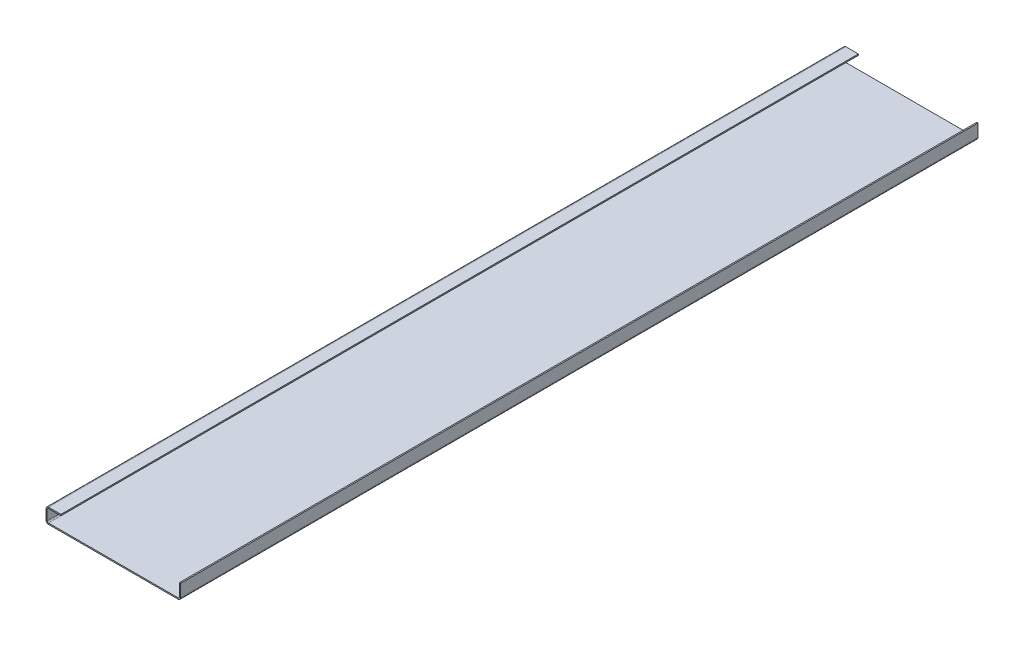
ISO-10303-21;
HEADER;
FILE_DESCRIPTION(('STEP AP214'),'2;1');
FILE_NAME('part.step','',(''),(''),'','','');
FILE_SCHEMA(('AUTOMOTIVE_DESIGN { 1 0 10303 214 1 1 1 1 }'));
ENDSEC;
DATA;
#1=APPLICATION_CONTEXT('core data for automotive mechanical design processes');
#2=APPLICATION_PROTOCOL_DEFINITION('international standard','automotive_design',2000,#1);
#3=PRODUCT_CONTEXT('',#1,'mechanical');
#4=PRODUCT('Part','Part','',(#3));
#5=PRODUCT_RELATED_PRODUCT_CATEGORY('part','',(#4));
#6=PRODUCT_DEFINITION_FORMATION('','',#4);
#7=PRODUCT_DEFINITION_CONTEXT('part definition',#1,'design');
#8=PRODUCT_DEFINITION('design','',#6,#7);
#9=PRODUCT_DEFINITION_SHAPE('','',#8);
#10=(LENGTH_UNIT() NAMED_UNIT(*) SI_UNIT(.MILLI.,.METRE.));
#11=(NAMED_UNIT(*) PLANE_ANGLE_UNIT() SI_UNIT($,.RADIAN.));
#12=(NAMED_UNIT(*) SI_UNIT($,.STERADIAN.) SOLID_ANGLE_UNIT());
#13=UNCERTAINTY_MEASURE_WITH_UNIT(LENGTH_MEASURE(1.E-05),#10,'distance_accuracy_value','');
#14=(GEOMETRIC_REPRESENTATION_CONTEXT(3) GLOBAL_UNCERTAINTY_ASSIGNED_CONTEXT((#13)) GLOBAL_UNIT_ASSIGNED_CONTEXT((#10,
#11,#12)) REPRESENTATION_CONTEXT('',''));
#15=CARTESIAN_POINT('',(0.,0.,0.));
#16=DIRECTION('',(0.,0.,1.));
#17=DIRECTION('',(1.,0.,0.));
#18=AXIS2_PLACEMENT_3D('',#15,#16,#17);
#19=CARTESIAN_POINT('',(-25.,0.,1600.));
#20=DIRECTION('',(0.,0.,1.));
#21=DIRECTION('',(1.,0.,0.));
#22=AXIS2_PLACEMENT_3D('',#19,#20,#21);
#23=PLANE('',#22);
#24=DIRECTION('',(0.,-1.,0.));
#25=VECTOR('',#24,1.);
#26=CARTESIAN_POINT('',(-25.,0.,1600.));
#27=LINE('',#26,#25);
#28=CARTESIAN_POINT('',(-25.,0.,1600.));
#29=VERTEX_POINT('',#28);
#30=CARTESIAN_POINT('',(-25.,-2.5,1600.));
#31=VERTEX_POINT('',#30);
#32=EDGE_CURVE('E11',#29,#31,#27,.T.);
#33=ORIENTED_EDGE('',*,*,#32,.F.);
#34=CARTESIAN_POINT('',(-25.,-5.,1600.));
#35=DIRECTION('',(0.,0.,-1.));
#36=DIRECTION('',(-1.,0.,0.));
#37=AXIS2_PLACEMENT_3D('',#34,#35,#36);
#38=CIRCLE('',#37,5.);
#39=CARTESIAN_POINT('',(-30.,-5.,1600.));
#40=VERTEX_POINT('',#39);
#41=EDGE_CURVE('E308',#29,#40,#38,.F.);
#42=ORIENTED_EDGE('',*,*,#41,.T.);
#43=DIRECTION('',(-1.,0.,0.));
#44=VECTOR('',#43,1.);
#45=CARTESIAN_POINT('',(-27.5,-5.,1600.));
#46=LINE('',#45,#44);
#47=CARTESIAN_POINT('',(-27.5,-5.,1600.));
#48=VERTEX_POINT('',#47);
#49=EDGE_CURVE('E49',#48,#40,#46,.T.);
#50=ORIENTED_EDGE('',*,*,#49,.F.);
#51=CARTESIAN_POINT('',(-25.,-5.,1600.));
#52=DIRECTION('',(0.,0.,1.));
#53=DIRECTION('',(1.,0.,0.));
#54=AXIS2_PLACEMENT_3D('',#51,#52,#53);
#55=CIRCLE('',#54,2.5);
#56=EDGE_CURVE('E327',#31,#48,#55,.T.);
#57=ORIENTED_EDGE('',*,*,#56,.F.);
#58=EDGE_LOOP('',(#33,#42,#50,#57));
#59=FACE_BOUND('',#58,.T.);
#60=ADVANCED_FACE('F41',(#59),#23,.T.);
#61=CARTESIAN_POINT('',(-27.5,-5.,1600.));
#62=DIRECTION('',(0.,0.,1.));
#63=DIRECTION('',(1.,0.,0.));
#64=AXIS2_PLACEMENT_3D('',#61,#62,#63);
#65=PLANE('',#64);
#66=DIRECTION('',(-1.,0.,0.));
#67=VECTOR('',#66,1.);
#68=CARTESIAN_POINT('',(0.,0.,1600.));
#69=LINE('',#68,#67);
#70=CARTESIAN_POINT('',(0.,0.,1600.));
#71=VERTEX_POINT('',#70);
#72=EDGE_CURVE('E312',#71,#29,#69,.T.);
#73=ORIENTED_EDGE('',*,*,#72,.T.);
#74=ORIENTED_EDGE('',*,*,#32,.T.);
#75=DIRECTION('',(-1.,0.,0.));
#76=VECTOR('',#75,1.);
#77=CARTESIAN_POINT('',(0.,-2.5,1600.));
#78=LINE('',#77,#76);
#79=CARTESIAN_POINT('',(0.,-2.5,1600.));
#80=VERTEX_POINT('',#79);
#81=EDGE_CURVE('E324',#80,#31,#78,.T.);
#82=ORIENTED_EDGE('',*,*,#81,.F.);
#83=DIRECTION('',(0.,-1.,0.));
#84=VECTOR('',#83,1.);
#85=CARTESIAN_POINT('',(0.,0.,1600.));
#86=LINE('',#85,#84);
#87=EDGE_CURVE('E321',#71,#80,#86,.T.);
#88=ORIENTED_EDGE('',*,*,#87,.F.);
#89=EDGE_LOOP('',(#73,#74,#82,#88));
#90=FACE_BOUND('',#89,.T.);
#91=ADVANCED_FACE('F377',(#90),#65,.T.);
#92=CARTESIAN_POINT('',(-30.,-5.,0.));
#93=DIRECTION('',(0.,0.,-1.));
#94=DIRECTION('',(-1.,0.,0.));
#95=AXIS2_PLACEMENT_3D('',#92,#93,#94);
#96=PLANE('',#95);
#97=DIRECTION('',(1.,0.,0.));
#98=VECTOR('',#97,1.);
#99=CARTESIAN_POINT('',(-30.,-5.,0.));
#100=LINE('',#99,#98);
#101=CARTESIAN_POINT('',(-30.,-5.,0.));
#102=VERTEX_POINT('',#101);
#103=CARTESIAN_POINT('',(-27.5,-5.,0.));
#104=VERTEX_POINT('',#103);
#105=EDGE_CURVE('E294',#102,#104,#100,.T.);
#106=ORIENTED_EDGE('',*,*,#105,.F.);
#107=CARTESIAN_POINT('',(-25.,-5.,0.));
#108=DIRECTION('',(0.,0.,-1.));
#109=DIRECTION('',(-1.,0.,0.));
#110=AXIS2_PLACEMENT_3D('',#107,#108,#109);
#111=CIRCLE('',#110,5.);
#112=CARTESIAN_POINT('',(-25.,0.,0.));
#113=VERTEX_POINT('',#112);
#114=EDGE_CURVE('E236',#113,#102,#111,.F.);
#115=ORIENTED_EDGE('',*,*,#114,.F.);
#116=DIRECTION('',(0.,1.,0.));
#117=VECTOR('',#116,1.);
#118=CARTESIAN_POINT('',(-25.,-2.5,0.));
#119=LINE('',#118,#117);
#120=CARTESIAN_POINT('',(-25.,-2.5,0.));
#121=VERTEX_POINT('',#120);
#122=EDGE_CURVE('E292',#121,#113,#119,.T.);
#123=ORIENTED_EDGE('',*,*,#122,.F.);
#124=CARTESIAN_POINT('',(-25.,-5.,0.));
#125=DIRECTION('',(0.,0.,1.));
#126=DIRECTION('',(1.,0.,0.));
#127=AXIS2_PLACEMENT_3D('',#124,#125,#126);
#128=CIRCLE('',#127,2.5);
#129=EDGE_CURVE('E224',#121,#104,#128,.T.);
#130=ORIENTED_EDGE('',*,*,#129,.T.);
#131=EDGE_LOOP('',(#106,#115,#123,#130));
#132=FACE_BOUND('',#131,.T.);
#133=ADVANCED_FACE('F387',(#132),#96,.T.);
#134=CARTESIAN_POINT('',(-25.,-2.5,0.));
#135=DIRECTION('',(0.,0.,-1.));
#136=DIRECTION('',(-1.,0.,0.));
#137=AXIS2_PLACEMENT_3D('',#134,#135,#136);
#138=PLANE('',#137);
#139=DIRECTION('',(0.,-1.,0.));
#140=VECTOR('',#139,1.);
#141=CARTESIAN_POINT('',(-30.,0.,0.));
#142=LINE('',#141,#140);
#143=CARTESIAN_POINT('',(-30.,-25.,0.));
#144=VERTEX_POINT('',#143);
#145=EDGE_CURVE('E239',#102,#144,#142,.T.);
#146=ORIENTED_EDGE('',*,*,#145,.F.);
#147=ORIENTED_EDGE('',*,*,#105,.T.);
#148=DIRECTION('',(0.,1.,0.));
#149=VECTOR('',#148,1.);
#150=CARTESIAN_POINT('',(-27.5,0.,0.));
#151=LINE('',#150,#149);
#152=CARTESIAN_POINT('',(-27.5,-25.,0.));
#153=VERTEX_POINT('',#152);
#154=EDGE_CURVE('E221',#104,#153,#151,.F.);
#155=ORIENTED_EDGE('',*,*,#154,.T.);
#156=DIRECTION('',(-1.,0.,0.));
#157=VECTOR('',#156,1.);
#158=CARTESIAN_POINT('',(-27.5,-25.,0.));
#159=LINE('',#158,#157);
#160=EDGE_CURVE('E288',#153,#144,#159,.T.);
#161=ORIENTED_EDGE('',*,*,#160,.T.);
#162=EDGE_LOOP('',(#146,#147,#155,#161));
#163=FACE_BOUND('',#162,.T.);
#164=ADVANCED_FACE('F389',(#163),#138,.T.);
#165=CARTESIAN_POINT('',(-30.,-25.,1600.));
#166=DIRECTION('',(0.,0.,1.));
#167=DIRECTION('',(1.,0.,0.));
#168=AXIS2_PLACEMENT_3D('',#165,#166,#167);
#169=PLANE('',#168);
#170=DIRECTION('',(1.,0.,0.));
#171=VECTOR('',#170,1.);
#172=CARTESIAN_POINT('',(-30.,-25.,1600.));
#173=LINE('',#172,#171);
#174=CARTESIAN_POINT('',(-30.,-25.,1600.));
#175=VERTEX_POINT('',#174);
#176=CARTESIAN_POINT('',(-27.5,-25.,1600.));
#177=VERTEX_POINT('',#176);
#178=EDGE_CURVE('E174',#175,#177,#173,.T.);
#179=ORIENTED_EDGE('',*,*,#178,.F.);
#180=CARTESIAN_POINT('',(-25.,-25.,1600.));
#181=DIRECTION('',(0.,0.,-1.));
#182=DIRECTION('',(-1.,0.,0.));
#183=AXIS2_PLACEMENT_3D('',#180,#181,#182);
#184=CIRCLE('',#183,5.);
#185=CARTESIAN_POINT('',(-25.,-30.,1600.));
#186=VERTEX_POINT('',#185);
#187=EDGE_CURVE('E178',#175,#186,#184,.F.);
#188=ORIENTED_EDGE('',*,*,#187,.T.);
#189=DIRECTION('',(0.,-1.,0.));
#190=VECTOR('',#189,1.);
#191=CARTESIAN_POINT('',(-25.,-27.5,1600.));
#192=LINE('',#191,#190);
#193=CARTESIAN_POINT('',(-25.,-27.5,1600.));
#194=VERTEX_POINT('',#193);
#195=EDGE_CURVE('E162',#194,#186,#192,.T.);
#196=ORIENTED_EDGE('',*,*,#195,.F.);
#197=CARTESIAN_POINT('',(-25.,-25.,1600.));
#198=DIRECTION('',(0.,0.,1.));
#199=DIRECTION('',(1.,0.,0.));
#200=AXIS2_PLACEMENT_3D('',#197,#198,#199);
#201=CIRCLE('',#200,2.5);
#202=EDGE_CURVE('E330',#177,#194,#201,.T.);
#203=ORIENTED_EDGE('',*,*,#202,.F.);
#204=EDGE_LOOP('',(#179,#188,#196,#203));
#205=FACE_BOUND('',#204,.T.);
#206=ADVANCED_FACE('F180',(#205),#169,.T.);
#207=CARTESIAN_POINT('',(-25.,-27.5,1600.));
#208=DIRECTION('',(0.,0.,1.));
#209=DIRECTION('',(1.,0.,0.));
#210=AXIS2_PLACEMENT_3D('',#207,#208,#209);
#211=PLANE('',#210);
#212=DIRECTION('',(0.,-1.,0.));
#213=VECTOR('',#212,1.);
#214=CARTESIAN_POINT('',(-30.,0.,1600.));
#215=LINE('',#214,#213);
#216=EDGE_CURVE('E184',#40,#175,#215,.T.);
#217=ORIENTED_EDGE('',*,*,#216,.T.);
#218=ORIENTED_EDGE('',*,*,#178,.T.);
#219=DIRECTION('',(0.,1.,0.));
#220=VECTOR('',#219,1.);
#221=CARTESIAN_POINT('',(-27.5,0.,1600.));
#222=LINE('',#221,#220);
#223=EDGE_CURVE('E302',#48,#177,#222,.F.);
#224=ORIENTED_EDGE('',*,*,#223,.F.);
#225=ORIENTED_EDGE('',*,*,#49,.T.);
#226=EDGE_LOOP('',(#217,#218,#224,#225));
#227=FACE_BOUND('',#226,.T.);
#228=ADVANCED_FACE('F298',(#227),#211,.T.);
#229=CARTESIAN_POINT('',(-25.,-30.,0.));
#230=DIRECTION('',(0.,0.,-1.));
#231=DIRECTION('',(-1.,0.,0.));
#232=AXIS2_PLACEMENT_3D('',#229,#230,#231);
#233=PLANE('',#232);
#234=DIRECTION('',(0.,1.,0.));
#235=VECTOR('',#234,1.);
#236=CARTESIAN_POINT('',(-25.,-30.,0.));
#237=LINE('',#236,#235);
#238=CARTESIAN_POINT('',(-25.,-30.,0.));
#239=VERTEX_POINT('',#238);
#240=CARTESIAN_POINT('',(-25.,-27.5,0.));
#241=VERTEX_POINT('',#240);
#242=EDGE_CURVE('E175',#239,#241,#237,.T.);
#243=ORIENTED_EDGE('',*,*,#242,.F.);
#244=CARTESIAN_POINT('',(-25.,-25.,0.));
#245=DIRECTION('',(0.,0.,-1.));
#246=DIRECTION('',(-1.,0.,0.));
#247=AXIS2_PLACEMENT_3D('',#244,#245,#246);
#248=CIRCLE('',#247,5.);
#249=EDGE_CURVE('E191',#144,#239,#248,.F.);
#250=ORIENTED_EDGE('',*,*,#249,.F.);
#251=ORIENTED_EDGE('',*,*,#160,.F.);
#252=CARTESIAN_POINT('',(-25.,-25.,0.));
#253=DIRECTION('',(0.,0.,1.));
#254=DIRECTION('',(1.,0.,0.));
#255=AXIS2_PLACEMENT_3D('',#252,#253,#254);
#256=CIRCLE('',#255,2.5);
#257=EDGE_CURVE('E218',#153,#241,#256,.T.);
#258=ORIENTED_EDGE('',*,*,#257,.T.);
#259=EDGE_LOOP('',(#243,#250,#251,#258));
#260=FACE_BOUND('',#259,.T.);
#261=ADVANCED_FACE('F391',(#260),#233,.T.);
#262=CARTESIAN_POINT('',(-27.5,-25.,0.));
#263=DIRECTION('',(0.,0.,-1.));
#264=DIRECTION('',(-1.,0.,0.));
#265=AXIS2_PLACEMENT_3D('',#262,#263,#264);
#266=PLANE('',#265);
#267=DIRECTION('',(1.,0.,0.));
#268=VECTOR('',#267,1.);
#269=CARTESIAN_POINT('',(-30.,-30.,0.));
#270=LINE('',#269,#268);
#271=CARTESIAN_POINT('',(235.,-30.,0.));
#272=VERTEX_POINT('',#271);
#273=EDGE_CURVE('E243',#239,#272,#270,.T.);
#274=ORIENTED_EDGE('',*,*,#273,.F.);
#275=ORIENTED_EDGE('',*,*,#242,.T.);
#276=DIRECTION('',(1.,0.,0.));
#277=VECTOR('',#276,1.);
#278=CARTESIAN_POINT('',(-30.,-27.5,0.));
#279=LINE('',#278,#277);
#280=CARTESIAN_POINT('',(235.,-27.5,0.));
#281=VERTEX_POINT('',#280);
#282=EDGE_CURVE('E216',#241,#281,#279,.T.);
#283=ORIENTED_EDGE('',*,*,#282,.T.);
#284=DIRECTION('',(0.,-1.,0.));
#285=VECTOR('',#284,1.);
#286=CARTESIAN_POINT('',(235.,-27.5,0.));
#287=LINE('',#286,#285);
#288=EDGE_CURVE('E110',#281,#272,#287,.T.);
#289=ORIENTED_EDGE('',*,*,#288,.T.);
#290=EDGE_LOOP('',(#274,#275,#283,#289));
#291=FACE_BOUND('',#290,.T.);
#292=ADVANCED_FACE('F392',(#291),#266,.T.);
#293=CARTESIAN_POINT('',(235.,-30.,1600.));
#294=DIRECTION('',(0.,0.,1.));
#295=DIRECTION('',(1.,0.,0.));
#296=AXIS2_PLACEMENT_3D('',#293,#294,#295);
#297=PLANE('',#296);
#298=DIRECTION('',(0.,1.,0.));
#299=VECTOR('',#298,1.);
#300=CARTESIAN_POINT('',(235.,-30.,1600.));
#301=LINE('',#300,#299);
#302=CARTESIAN_POINT('',(235.,-30.,1600.));
#303=VERTEX_POINT('',#302);
#304=CARTESIAN_POINT('',(235.,-27.5,1600.));
#305=VERTEX_POINT('',#304);
#306=EDGE_CURVE('E286',#303,#305,#301,.T.);
#307=ORIENTED_EDGE('',*,*,#306,.F.);
#308=CARTESIAN_POINT('',(235.,-25.,1600.));
#309=DIRECTION('',(0.,0.,-1.));
#310=DIRECTION('',(-1.,0.,0.));
#311=AXIS2_PLACEMENT_3D('',#308,#309,#310);
#312=CIRCLE('',#311,5.);
#313=CARTESIAN_POINT('',(240.,-25.,1600.));
#314=VERTEX_POINT('',#313);
#315=EDGE_CURVE('E199',#303,#314,#312,.F.);
#316=ORIENTED_EDGE('',*,*,#315,.T.);
#317=DIRECTION('',(1.,0.,0.));
#318=VECTOR('',#317,1.);
#319=CARTESIAN_POINT('',(237.5,-25.,1600.));
#320=LINE('',#319,#318);
#321=CARTESIAN_POINT('',(237.5,-25.,1600.));
#322=VERTEX_POINT('',#321);
#323=EDGE_CURVE('E57',#322,#314,#320,.T.);
#324=ORIENTED_EDGE('',*,*,#323,.F.);
#325=CARTESIAN_POINT('',(235.,-25.,1600.));
#326=DIRECTION('',(0.,0.,1.));
#327=DIRECTION('',(1.,0.,0.));
#328=AXIS2_PLACEMENT_3D('',#325,#326,#327);
#329=CIRCLE('',#328,2.5);
#330=EDGE_CURVE('E333',#305,#322,#329,.T.);
#331=ORIENTED_EDGE('',*,*,#330,.F.);
#332=EDGE_LOOP('',(#307,#316,#324,#331));
#333=FACE_BOUND('',#332,.T.);
#334=ADVANCED_FACE('F356',(#333),#297,.T.);
#335=CARTESIAN_POINT('',(237.5,-25.,1600.));
#336=DIRECTION('',(0.,0.,1.));
#337=DIRECTION('',(1.,0.,0.));
#338=AXIS2_PLACEMENT_3D('',#335,#336,#337);
#339=PLANE('',#338);
#340=DIRECTION('',(1.,0.,0.));
#341=VECTOR('',#340,1.);
#342=CARTESIAN_POINT('',(-30.,-30.,1600.));
#343=LINE('',#342,#341);
#344=EDGE_CURVE('E166',#186,#303,#343,.T.);
#345=ORIENTED_EDGE('',*,*,#344,.T.);
#346=ORIENTED_EDGE('',*,*,#306,.T.);
#347=DIRECTION('',(1.,0.,0.));
#348=VECTOR('',#347,1.);
#349=CARTESIAN_POINT('',(-30.,-27.5,1600.));
#350=LINE('',#349,#348);
#351=EDGE_CURVE('E169',#194,#305,#350,.T.);
#352=ORIENTED_EDGE('',*,*,#351,.F.);
#353=ORIENTED_EDGE('',*,*,#195,.T.);
#354=EDGE_LOOP('',(#345,#346,#352,#353));
#355=FACE_BOUND('',#354,.T.);
#356=ADVANCED_FACE('F164',(#355),#339,.T.);
#357=CARTESIAN_POINT('',(240.,-25.,0.));
#358=DIRECTION('',(0.,0.,-1.));
#359=DIRECTION('',(-1.,0.,0.));
#360=AXIS2_PLACEMENT_3D('',#357,#358,#359);
#361=PLANE('',#360);
#362=DIRECTION('',(-1.,0.,0.));
#363=VECTOR('',#362,1.);
#364=CARTESIAN_POINT('',(240.,-25.,0.));
#365=LINE('',#364,#363);
#366=CARTESIAN_POINT('',(240.,-25.,0.));
#367=VERTEX_POINT('',#366);
#368=CARTESIAN_POINT('',(237.5,-25.,0.));
#369=VERTEX_POINT('',#368);
#370=EDGE_CURVE('E117',#367,#369,#365,.T.);
#371=ORIENTED_EDGE('',*,*,#370,.F.);
#372=CARTESIAN_POINT('',(235.,-25.,0.));
#373=DIRECTION('',(0.,0.,-1.));
#374=DIRECTION('',(-1.,0.,0.));
#375=AXIS2_PLACEMENT_3D('',#372,#373,#374);
#376=CIRCLE('',#375,5.);
#377=EDGE_CURVE('E245',#272,#367,#376,.F.);
#378=ORIENTED_EDGE('',*,*,#377,.F.);
#379=ORIENTED_EDGE('',*,*,#288,.F.);
#380=CARTESIAN_POINT('',(235.,-25.,0.));
#381=DIRECTION('',(0.,0.,1.));
#382=DIRECTION('',(1.,0.,0.));
#383=AXIS2_PLACEMENT_3D('',#380,#381,#382);
#384=CIRCLE('',#383,2.5);
#385=EDGE_CURVE('E214',#281,#369,#384,.T.);
#386=ORIENTED_EDGE('',*,*,#385,.T.);
#387=EDGE_LOOP('',(#371,#378,#379,#386));
#388=FACE_BOUND('',#387,.T.);
#389=ADVANCED_FACE('F396',(#388),#361,.T.);
#390=CARTESIAN_POINT('',(235.,-27.5,0.));
#391=DIRECTION('',(0.,0.,-1.));
#392=DIRECTION('',(-1.,0.,0.));
#393=AXIS2_PLACEMENT_3D('',#390,#391,#392);
#394=PLANE('',#393);
#395=DIRECTION('',(0.,1.,0.));
#396=VECTOR('',#395,1.);
#397=CARTESIAN_POINT('',(240.,-30.,0.));
#398=LINE('',#397,#396);
#399=CARTESIAN_POINT('',(240.,0.,0.));
#400=VERTEX_POINT('',#399);
#401=EDGE_CURVE('E205',#367,#400,#398,.T.);
#402=ORIENTED_EDGE('',*,*,#401,.F.);
#403=ORIENTED_EDGE('',*,*,#370,.T.);
#404=DIRECTION('',(0.,1.,0.));
#405=VECTOR('',#404,1.);
#406=CARTESIAN_POINT('',(237.5,-30.,0.));
#407=LINE('',#406,#405);
#408=CARTESIAN_POINT('',(237.5,0.,0.));
#409=VERTEX_POINT('',#408);
#410=EDGE_CURVE('E211',#369,#409,#407,.T.);
#411=ORIENTED_EDGE('',*,*,#410,.T.);
#412=DIRECTION('',(1.,0.,0.));
#413=VECTOR('',#412,1.);
#414=CARTESIAN_POINT('',(237.5,0.,0.));
#415=LINE('',#414,#413);
#416=EDGE_CURVE('E208',#409,#400,#415,.T.);
#417=ORIENTED_EDGE('',*,*,#416,.T.);
#418=EDGE_LOOP('',(#402,#403,#411,#417));
#419=FACE_BOUND('',#418,.T.);
#420=ADVANCED_FACE('F398',(#419),#394,.T.);
#421=CARTESIAN_POINT('',(240.,-30.,1600.));
#422=DIRECTION('',(-1.,0.,0.));
#423=DIRECTION('',(0.,0.,1.));
#424=AXIS2_PLACEMENT_3D('',#421,#422,#423);
#425=PLANE('',#424);
#426=ORIENTED_EDGE('',*,*,#401,.T.);
#427=DIRECTION('',(0.,0.,-1.));
#428=VECTOR('',#427,1.);
#429=CARTESIAN_POINT('',(240.,0.,1600.));
#430=LINE('',#429,#428);
#431=CARTESIAN_POINT('',(240.,0.,1600.));
#432=VERTEX_POINT('',#431);
#433=EDGE_CURVE('E281',#432,#400,#430,.T.);
#434=ORIENTED_EDGE('',*,*,#433,.F.);
#435=DIRECTION('',(0.,1.,0.));
#436=VECTOR('',#435,1.);
#437=CARTESIAN_POINT('',(240.,-30.,1600.));
#438=LINE('',#437,#436);
#439=EDGE_CURVE('E123',#314,#432,#438,.T.);
#440=ORIENTED_EDGE('',*,*,#439,.F.);
#441=DIRECTION('',(0.,0.,-1.));
#442=VECTOR('',#441,1.);
#443=CARTESIAN_POINT('',(240.,-25.,1600.));
#444=LINE('',#443,#442);
#445=EDGE_CURVE('E201',#314,#367,#444,.T.);
#446=ORIENTED_EDGE('',*,*,#445,.T.);
#447=EDGE_LOOP('',(#426,#434,#440,#446));
#448=FACE_BOUND('',#447,.T.);
#449=ADVANCED_FACE('F404',(#448),#425,.F.);
#450=CARTESIAN_POINT('',(237.5,0.,1600.));
#451=DIRECTION('',(0.,1.,0.));
#452=DIRECTION('',(0.,0.,1.));
#453=AXIS2_PLACEMENT_3D('',#450,#451,#452);
#454=PLANE('',#453);
#455=ORIENTED_EDGE('',*,*,#416,.F.);
#456=DIRECTION('',(0.,0.,-1.));
#457=VECTOR('',#456,1.);
#458=CARTESIAN_POINT('',(237.5,0.,1600.));
#459=LINE('',#458,#457);
#460=CARTESIAN_POINT('',(237.5,0.,1600.));
#461=VERTEX_POINT('',#460);
#462=EDGE_CURVE('E279',#461,#409,#459,.T.);
#463=ORIENTED_EDGE('',*,*,#462,.F.);
#464=DIRECTION('',(1.,0.,0.));
#465=VECTOR('',#464,1.);
#466=CARTESIAN_POINT('',(237.5,0.,1600.));
#467=LINE('',#466,#465);
#468=EDGE_CURVE('E339',#461,#432,#467,.T.);
#469=ORIENTED_EDGE('',*,*,#468,.T.);
#470=ORIENTED_EDGE('',*,*,#433,.T.);
#471=EDGE_LOOP('',(#455,#463,#469,#470));
#472=FACE_BOUND('',#471,.T.);
#473=ADVANCED_FACE('F344',(#472),#454,.T.);
#474=CARTESIAN_POINT('',(237.5,-30.,1600.));
#475=DIRECTION('',(-1.,0.,0.));
#476=DIRECTION('',(0.,0.,1.));
#477=AXIS2_PLACEMENT_3D('',#474,#475,#476);
#478=PLANE('',#477);
#479=ORIENTED_EDGE('',*,*,#410,.F.);
#480=DIRECTION('',(0.,0.,-1.));
#481=VECTOR('',#480,1.);
#482=CARTESIAN_POINT('',(237.5,-25.,1600.));
#483=LINE('',#482,#481);
#484=EDGE_CURVE('E276',#322,#369,#483,.T.);
#485=ORIENTED_EDGE('',*,*,#484,.F.);
#486=DIRECTION('',(0.,1.,0.));
#487=VECTOR('',#486,1.);
#488=CARTESIAN_POINT('',(237.5,-30.,1600.));
#489=LINE('',#488,#487);
#490=EDGE_CURVE('E336',#322,#461,#489,.T.);
#491=ORIENTED_EDGE('',*,*,#490,.T.);
#492=ORIENTED_EDGE('',*,*,#462,.T.);
#493=EDGE_LOOP('',(#479,#485,#491,#492));
#494=FACE_BOUND('',#493,.T.);
#495=ADVANCED_FACE('F349',(#494),#478,.T.);
#496=CARTESIAN_POINT('',(235.,-25.,1600.));
#497=DIRECTION('',(0.,0.,-1.));
#498=DIRECTION('',(-1.,0.,0.));
#499=AXIS2_PLACEMENT_3D('',#496,#497,#498);
#500=CYLINDRICAL_SURFACE('',#499,2.5);
#501=ORIENTED_EDGE('',*,*,#385,.F.);
#502=DIRECTION('',(0.,0.,-1.));
#503=VECTOR('',#502,1.);
#504=CARTESIAN_POINT('',(235.,-27.5,1600.));
#505=LINE('',#504,#503);
#506=EDGE_CURVE('E273',#305,#281,#505,.T.);
#507=ORIENTED_EDGE('',*,*,#506,.F.);
#508=ORIENTED_EDGE('',*,*,#330,.T.);
#509=ORIENTED_EDGE('',*,*,#484,.T.);
#510=EDGE_LOOP('',(#501,#507,#508,#509));
#511=FACE_BOUND('',#510,.T.);
#512=ADVANCED_FACE('F352',(#511),#500,.F.);
#513=CARTESIAN_POINT('',(-30.,-27.5,1600.));
#514=DIRECTION('',(0.,1.,0.));
#515=DIRECTION('',(0.,0.,1.));
#516=AXIS2_PLACEMENT_3D('',#513,#514,#515);
#517=PLANE('',#516);
#518=ORIENTED_EDGE('',*,*,#282,.F.);
#519=DIRECTION('',(0.,0.,-1.));
#520=VECTOR('',#519,1.);
#521=CARTESIAN_POINT('',(-25.,-27.5,1600.));
#522=LINE('',#521,#520);
#523=EDGE_CURVE('E270',#194,#241,#522,.T.);
#524=ORIENTED_EDGE('',*,*,#523,.F.);
#525=ORIENTED_EDGE('',*,*,#351,.T.);
#526=ORIENTED_EDGE('',*,*,#506,.T.);
#527=EDGE_LOOP('',(#518,#524,#525,#526));
#528=FACE_BOUND('',#527,.T.);
#529=ADVANCED_FACE('F359',(#528),#517,.T.);
#530=CARTESIAN_POINT('',(-25.,-25.,1600.));
#531=DIRECTION('',(0.,0.,-1.));
#532=DIRECTION('',(-1.,0.,0.));
#533=AXIS2_PLACEMENT_3D('',#530,#531,#532);
#534=CYLINDRICAL_SURFACE('',#533,2.5);
#535=ORIENTED_EDGE('',*,*,#257,.F.);
#536=DIRECTION('',(0.,0.,-1.));
#537=VECTOR('',#536,1.);
#538=CARTESIAN_POINT('',(-27.5,-25.,1600.));
#539=LINE('',#538,#537);
#540=EDGE_CURVE('E267',#177,#153,#539,.T.);
#541=ORIENTED_EDGE('',*,*,#540,.F.);
#542=ORIENTED_EDGE('',*,*,#202,.T.);
#543=ORIENTED_EDGE('',*,*,#523,.T.);
#544=EDGE_LOOP('',(#535,#541,#542,#543));
#545=FACE_BOUND('',#544,.T.);
#546=ADVANCED_FACE('F362',(#545),#534,.F.);
#547=CARTESIAN_POINT('',(-27.5,0.,1600.));
#548=DIRECTION('',(1.,0.,0.));
#549=DIRECTION('',(0.,0.,-1.));
#550=AXIS2_PLACEMENT_3D('',#547,#548,#549);
#551=PLANE('',#550);
#552=ORIENTED_EDGE('',*,*,#154,.F.);
#553=DIRECTION('',(0.,0.,-1.));
#554=VECTOR('',#553,1.);
#555=CARTESIAN_POINT('',(-27.5,-5.,1600.));
#556=LINE('',#555,#554);
#557=EDGE_CURVE('E264',#48,#104,#556,.T.);
#558=ORIENTED_EDGE('',*,*,#557,.F.);
#559=ORIENTED_EDGE('',*,*,#223,.T.);
#560=ORIENTED_EDGE('',*,*,#540,.T.);
#561=EDGE_LOOP('',(#552,#558,#559,#560));
#562=FACE_BOUND('',#561,.T.);
#563=ADVANCED_FACE('F366',(#562),#551,.T.);
#564=CARTESIAN_POINT('',(-25.,-5.,1600.));
#565=DIRECTION('',(0.,0.,-1.));
#566=DIRECTION('',(-1.,0.,0.));
#567=AXIS2_PLACEMENT_3D('',#564,#565,#566);
#568=CYLINDRICAL_SURFACE('',#567,2.5);
#569=ORIENTED_EDGE('',*,*,#129,.F.);
#570=DIRECTION('',(0.,0.,-1.));
#571=VECTOR('',#570,1.);
#572=CARTESIAN_POINT('',(-25.,-2.5,1600.));
#573=LINE('',#572,#571);
#574=EDGE_CURVE('E261',#31,#121,#573,.T.);
#575=ORIENTED_EDGE('',*,*,#574,.F.);
#576=ORIENTED_EDGE('',*,*,#56,.T.);
#577=ORIENTED_EDGE('',*,*,#557,.T.);
#578=EDGE_LOOP('',(#569,#575,#576,#577));
#579=FACE_BOUND('',#578,.T.);
#580=ADVANCED_FACE('F369',(#579),#568,.F.);
#581=CARTESIAN_POINT('',(0.,-2.5,1600.));
#582=DIRECTION('',(0.,-1.,0.));
#583=DIRECTION('',(1.,0.,0.));
#584=AXIS2_PLACEMENT_3D('',#581,#582,#583);
#585=PLANE('',#584);
#586=DIRECTION('',(-1.,0.,0.));
#587=VECTOR('',#586,1.);
#588=CARTESIAN_POINT('',(0.,-2.5,0.));
#589=LINE('',#588,#587);
#590=CARTESIAN_POINT('',(0.,-2.5,0.));
#591=VERTEX_POINT('',#590);
#592=EDGE_CURVE('E227',#591,#121,#589,.T.);
#593=ORIENTED_EDGE('',*,*,#592,.F.);
#594=DIRECTION('',(0.,0.,-1.));
#595=VECTOR('',#594,1.);
#596=CARTESIAN_POINT('',(0.,-2.5,1600.));
#597=LINE('',#596,#595);
#598=EDGE_CURVE('E259',#80,#591,#597,.T.);
#599=ORIENTED_EDGE('',*,*,#598,.F.);
#600=ORIENTED_EDGE('',*,*,#81,.T.);
#601=ORIENTED_EDGE('',*,*,#574,.T.);
#602=EDGE_LOOP('',(#593,#599,#600,#601));
#603=FACE_BOUND('',#602,.T.);
#604=ADVANCED_FACE('F374',(#603),#585,.T.);
#605=CARTESIAN_POINT('',(0.,0.,1600.));
#606=DIRECTION('',(1.,0.,0.));
#607=DIRECTION('',(0.,1.,0.));
#608=AXIS2_PLACEMENT_3D('',#605,#606,#607);
#609=PLANE('',#608);
#610=DIRECTION('',(0.,-1.,0.));
#611=VECTOR('',#610,1.);
#612=CARTESIAN_POINT('',(0.,0.,0.));
#613=LINE('',#612,#611);
#614=CARTESIAN_POINT('',(0.,0.,0.));
#615=VERTEX_POINT('',#614);
#616=EDGE_CURVE('E230',#615,#591,#613,.T.);
#617=ORIENTED_EDGE('',*,*,#616,.F.);
#618=DIRECTION('',(0.,0.,-1.));
#619=VECTOR('',#618,1.);
#620=CARTESIAN_POINT('',(0.,0.,1600.));
#621=LINE('',#620,#619);
#622=EDGE_CURVE('E257',#71,#615,#621,.T.);
#623=ORIENTED_EDGE('',*,*,#622,.F.);
#624=ORIENTED_EDGE('',*,*,#87,.T.);
#625=ORIENTED_EDGE('',*,*,#598,.T.);
#626=EDGE_LOOP('',(#617,#623,#624,#625));
#627=FACE_BOUND('',#626,.T.);
#628=ADVANCED_FACE('F380',(#627),#609,.T.);
#629=CARTESIAN_POINT('',(0.,0.,1600.));
#630=DIRECTION('',(0.,-1.,0.));
#631=DIRECTION('',(1.,0.,0.));
#632=AXIS2_PLACEMENT_3D('',#629,#630,#631);
#633=PLANE('',#632);
#634=DIRECTION('',(-1.,0.,0.));
#635=VECTOR('',#634,1.);
#636=CARTESIAN_POINT('',(0.,0.,0.));
#637=LINE('',#636,#635);
#638=EDGE_CURVE('E233',#615,#113,#637,.T.);
#639=ORIENTED_EDGE('',*,*,#638,.T.);
#640=DIRECTION('',(0.,0.,-1.));
#641=VECTOR('',#640,1.);
#642=CARTESIAN_POINT('',(-25.,0.,1600.));
#643=LINE('',#642,#641);
#644=EDGE_CURVE('E254',#29,#113,#643,.T.);
#645=ORIENTED_EDGE('',*,*,#644,.F.);
#646=ORIENTED_EDGE('',*,*,#72,.F.);
#647=ORIENTED_EDGE('',*,*,#622,.T.);
#648=EDGE_LOOP('',(#639,#645,#646,#647));
#649=FACE_BOUND('',#648,.T.);
#650=ADVANCED_FACE('F385',(#649),#633,.F.);
#651=CARTESIAN_POINT('',(-25.,-5.,1600.));
#652=DIRECTION('',(0.,0.,-1.));
#653=DIRECTION('',(-1.,0.,0.));
#654=AXIS2_PLACEMENT_3D('',#651,#652,#653);
#655=CYLINDRICAL_SURFACE('',#654,5.);
#656=ORIENTED_EDGE('',*,*,#114,.T.);
#657=DIRECTION('',(0.,0.,-1.));
#658=VECTOR('',#657,1.);
#659=CARTESIAN_POINT('',(-30.,-5.,1600.));
#660=LINE('',#659,#658);
#661=EDGE_CURVE('E251',#40,#102,#660,.T.);
#662=ORIENTED_EDGE('',*,*,#661,.F.);
#663=ORIENTED_EDGE('',*,*,#41,.F.);
#664=ORIENTED_EDGE('',*,*,#644,.T.);
#665=EDGE_LOOP('',(#656,#662,#663,#664));
#666=FACE_BOUND('',#665,.T.);
#667=ADVANCED_FACE('F314',(#666),#655,.T.);
#668=CARTESIAN_POINT('',(-30.,0.,1600.));
#669=DIRECTION('',(1.,0.,0.));
#670=DIRECTION('',(0.,0.,-1.));
#671=AXIS2_PLACEMENT_3D('',#668,#669,#670);
#672=PLANE('',#671);
#673=ORIENTED_EDGE('',*,*,#145,.T.);
#674=DIRECTION('',(0.,0.,-1.));
#675=VECTOR('',#674,1.);
#676=CARTESIAN_POINT('',(-30.,-25.,1600.));
#677=LINE('',#676,#675);
#678=EDGE_CURVE('E193',#175,#144,#677,.T.);
#679=ORIENTED_EDGE('',*,*,#678,.F.);
#680=ORIENTED_EDGE('',*,*,#216,.F.);
#681=ORIENTED_EDGE('',*,*,#661,.T.);
#682=EDGE_LOOP('',(#673,#679,#680,#681));
#683=FACE_BOUND('',#682,.T.);
#684=ADVANCED_FACE('F318',(#683),#672,.F.);
#685=CARTESIAN_POINT('',(-25.,-25.,1600.));
#686=DIRECTION('',(0.,0.,-1.));
#687=DIRECTION('',(-1.,0.,0.));
#688=AXIS2_PLACEMENT_3D('',#685,#686,#687);
#689=CYLINDRICAL_SURFACE('',#688,5.);
#690=ORIENTED_EDGE('',*,*,#249,.T.);
#691=DIRECTION('',(0.,0.,-1.));
#692=VECTOR('',#691,1.);
#693=CARTESIAN_POINT('',(-25.,-30.,1600.));
#694=LINE('',#693,#692);
#695=EDGE_CURVE('E188',#186,#239,#694,.T.);
#696=ORIENTED_EDGE('',*,*,#695,.F.);
#697=ORIENTED_EDGE('',*,*,#187,.F.);
#698=ORIENTED_EDGE('',*,*,#678,.T.);
#699=EDGE_LOOP('',(#690,#696,#697,#698));
#700=FACE_BOUND('',#699,.T.);
#701=ADVANCED_FACE('F189',(#700),#689,.T.);
#702=CARTESIAN_POINT('',(-30.,-30.,1600.));
#703=DIRECTION('',(0.,1.,0.));
#704=DIRECTION('',(0.,0.,1.));
#705=AXIS2_PLACEMENT_3D('',#702,#703,#704);
#706=PLANE('',#705);
#707=ORIENTED_EDGE('',*,*,#273,.T.);
#708=DIRECTION('',(0.,0.,-1.));
#709=VECTOR('',#708,1.);
#710=CARTESIAN_POINT('',(235.,-30.,1600.));
#711=LINE('',#710,#709);
#712=EDGE_CURVE('E194',#303,#272,#711,.T.);
#713=ORIENTED_EDGE('',*,*,#712,.F.);
#714=ORIENTED_EDGE('',*,*,#344,.F.);
#715=ORIENTED_EDGE('',*,*,#695,.T.);
#716=EDGE_LOOP('',(#707,#713,#714,#715));
#717=FACE_BOUND('',#716,.T.);
#718=ADVANCED_FACE('F196',(#717),#706,.F.);
#719=CARTESIAN_POINT('',(235.,-25.,1600.));
#720=DIRECTION('',(0.,0.,-1.));
#721=DIRECTION('',(-1.,0.,0.));
#722=AXIS2_PLACEMENT_3D('',#719,#720,#721);
#723=CYLINDRICAL_SURFACE('',#722,5.);
#724=ORIENTED_EDGE('',*,*,#377,.T.);
#725=ORIENTED_EDGE('',*,*,#445,.F.);
#726=ORIENTED_EDGE('',*,*,#315,.F.);
#727=ORIENTED_EDGE('',*,*,#712,.T.);
#728=EDGE_LOOP('',(#724,#725,#726,#727));
#729=FACE_BOUND('',#728,.T.);
#730=ADVANCED_FACE('F394',(#729),#723,.T.);
#731=CARTESIAN_POINT('',(235.,-25.,1600.));
#732=DIRECTION('',(0.,0.,1.));
#733=DIRECTION('',(1.,0.,0.));
#734=AXIS2_PLACEMENT_3D('',#731,#732,#733);
#735=PLANE('',#734);
#736=ORIENTED_EDGE('',*,*,#439,.T.);
#737=ORIENTED_EDGE('',*,*,#468,.F.);
#738=ORIENTED_EDGE('',*,*,#490,.F.);
#739=ORIENTED_EDGE('',*,*,#323,.T.);
#740=EDGE_LOOP('',(#736,#737,#738,#739));
#741=FACE_BOUND('',#740,.T.);
#742=ADVANCED_FACE('F345',(#741),#735,.T.);
#743=CARTESIAN_POINT('',(235.,-25.,0.));
#744=DIRECTION('',(0.,0.,1.));
#745=DIRECTION('',(1.,0.,0.));
#746=AXIS2_PLACEMENT_3D('',#743,#744,#745);
#747=PLANE('',#746);
#748=ORIENTED_EDGE('',*,*,#592,.T.);
#749=ORIENTED_EDGE('',*,*,#122,.T.);
#750=ORIENTED_EDGE('',*,*,#638,.F.);
#751=ORIENTED_EDGE('',*,*,#616,.T.);
#752=EDGE_LOOP('',(#748,#749,#750,#751));
#753=FACE_BOUND('',#752,.T.);
#754=ADVANCED_FACE('F603',(#753),#747,.F.);
#755=CLOSED_SHELL('',(#60,#91,#133,#164,#206,#228,#261,#292,#334,#356,#389,#420,#449,#473,#495,
#512,#529,#546,#563,#580,#604,#628,#650,#667,#684,#701,#718,#730,#742,#754));
#756=MANIFOLD_SOLID_BREP('B2',#755);
#757=ADVANCED_BREP_SHAPE_REPRESENTATION('',(#18,#756),#14);
#758=SHAPE_DEFINITION_REPRESENTATION(#9,#757);
ENDSEC;
END-ISO-10303-21;
